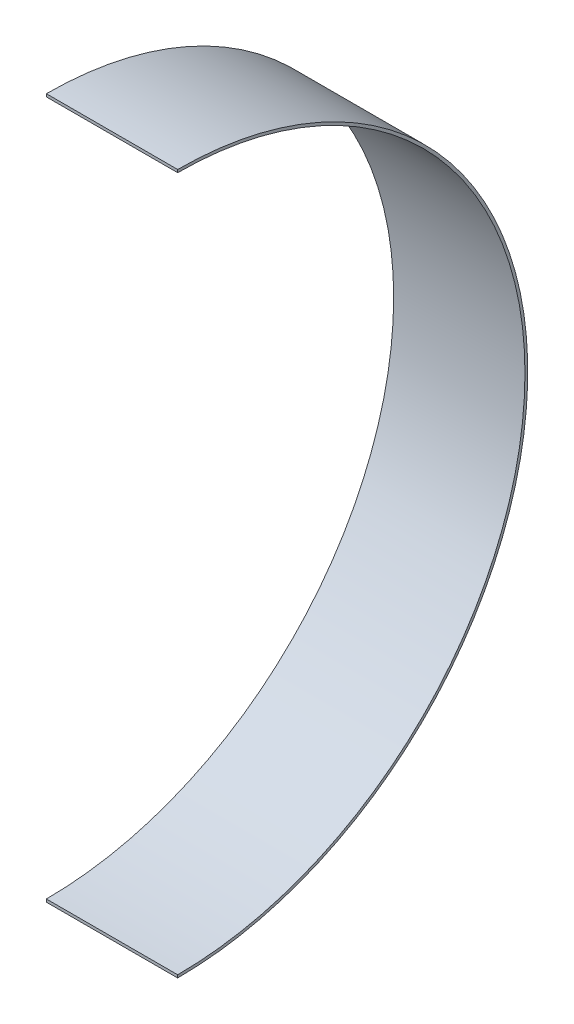
ISO-10303-21;
HEADER;
FILE_DESCRIPTION(('STEP AP214'),'2;1');
FILE_NAME('part.step','',(''),(''),'','','');
FILE_SCHEMA(('AUTOMOTIVE_DESIGN { 1 0 10303 214 1 1 1 1 }'));
ENDSEC;
DATA;
#1=APPLICATION_CONTEXT('core data for automotive mechanical design processes');
#2=APPLICATION_PROTOCOL_DEFINITION('international standard','automotive_design',2000,#1);
#3=PRODUCT_CONTEXT('',#1,'mechanical');
#4=PRODUCT('Part','Part','',(#3));
#5=PRODUCT_RELATED_PRODUCT_CATEGORY('part','',(#4));
#6=PRODUCT_DEFINITION_FORMATION('','',#4);
#7=PRODUCT_DEFINITION_CONTEXT('part definition',#1,'design');
#8=PRODUCT_DEFINITION('design','',#6,#7);
#9=PRODUCT_DEFINITION_SHAPE('','',#8);
#10=(LENGTH_UNIT() NAMED_UNIT(*) SI_UNIT(.MILLI.,.METRE.));
#11=(NAMED_UNIT(*) PLANE_ANGLE_UNIT() SI_UNIT($,.RADIAN.));
#12=(NAMED_UNIT(*) SI_UNIT($,.STERADIAN.) SOLID_ANGLE_UNIT());
#13=UNCERTAINTY_MEASURE_WITH_UNIT(LENGTH_MEASURE(1.E-05),#10,'distance_accuracy_value','');
#14=(GEOMETRIC_REPRESENTATION_CONTEXT(3) GLOBAL_UNCERTAINTY_ASSIGNED_CONTEXT((#13)) GLOBAL_UNIT_ASSIGNED_CONTEXT((#10,
#11,#12)) REPRESENTATION_CONTEXT('',''));
#15=CARTESIAN_POINT('',(0.,0.,0.));
#16=DIRECTION('',(0.,0.,1.));
#17=DIRECTION('',(1.,0.,0.));
#18=AXIS2_PLACEMENT_3D('',#15,#16,#17);
#19=CARTESIAN_POINT('',(75.,0.,0.));
#20=DIRECTION('',(-1.,0.,0.));
#21=DIRECTION('',(0.,0.,1.));
#22=AXIS2_PLACEMENT_3D('',#19,#20,#21);
#23=CYLINDRICAL_SURFACE('',#22,198.4);
#24=CARTESIAN_POINT('',(0.,0.,0.));
#25=DIRECTION('',(1.,0.,0.));
#26=DIRECTION('',(0.,0.,-1.));
#27=AXIS2_PLACEMENT_3D('',#24,#25,#26);
#28=CIRCLE('',#27,198.4);
#29=CARTESIAN_POINT('',(0.,-198.4,0.));
#30=VERTEX_POINT('',#29);
#31=CARTESIAN_POINT('',(0.,198.4,0.));
#32=VERTEX_POINT('',#31);
#33=EDGE_CURVE('E92',#30,#32,#28,.T.);
#34=ORIENTED_EDGE('',*,*,#33,.F.);
#35=DIRECTION('',(-1.,0.,0.));
#36=VECTOR('',#35,1.);
#37=CARTESIAN_POINT('',(75.,-198.4,0.));
#38=LINE('',#37,#36);
#39=CARTESIAN_POINT('',(75.,-198.4,0.));
#40=VERTEX_POINT('',#39);
#41=EDGE_CURVE('E11',#40,#30,#38,.T.);
#42=ORIENTED_EDGE('',*,*,#41,.F.);
#43=CARTESIAN_POINT('',(75.,0.,0.));
#44=DIRECTION('',(1.,0.,0.));
#45=DIRECTION('',(0.,0.,-1.));
#46=AXIS2_PLACEMENT_3D('',#43,#44,#45);
#47=CIRCLE('',#46,198.4);
#48=CARTESIAN_POINT('',(75.,198.4,0.));
#49=VERTEX_POINT('',#48);
#50=EDGE_CURVE('E81',#40,#49,#47,.T.);
#51=ORIENTED_EDGE('',*,*,#50,.T.);
#52=DIRECTION('',(-1.,0.,0.));
#53=VECTOR('',#52,1.);
#54=CARTESIAN_POINT('',(75.,198.4,0.));
#55=LINE('',#54,#53);
#56=EDGE_CURVE('E70',#49,#32,#55,.T.);
#57=ORIENTED_EDGE('',*,*,#56,.T.);
#58=EDGE_LOOP('',(#34,#42,#51,#57));
#59=FACE_BOUND('',#58,.T.);
#60=ADVANCED_FACE('F31',(#59),#23,.F.);
#61=CARTESIAN_POINT('',(75.,0.,0.));
#62=DIRECTION('',(0.,0.,-1.));
#63=DIRECTION('',(-1.,0.,0.));
#64=AXIS2_PLACEMENT_3D('',#61,#62,#63);
#65=PLANE('',#64);
#66=DIRECTION('',(0.,-1.,0.));
#67=VECTOR('',#66,1.);
#68=CARTESIAN_POINT('',(0.,0.,0.));
#69=LINE('',#68,#67);
#70=CARTESIAN_POINT('',(0.,-200.,0.));
#71=VERTEX_POINT('',#70);
#72=EDGE_CURVE('E86',#30,#71,#69,.T.);
#73=ORIENTED_EDGE('',*,*,#72,.T.);
#74=DIRECTION('',(-1.,0.,0.));
#75=VECTOR('',#74,1.);
#76=CARTESIAN_POINT('',(75.,-200.,0.));
#77=LINE('',#76,#75);
#78=CARTESIAN_POINT('',(75.,-200.,0.));
#79=VERTEX_POINT('',#78);
#80=EDGE_CURVE('E39',#79,#71,#77,.T.);
#81=ORIENTED_EDGE('',*,*,#80,.F.);
#82=DIRECTION('',(0.,-1.,0.));
#83=VECTOR('',#82,1.);
#84=CARTESIAN_POINT('',(75.,0.,0.));
#85=LINE('',#84,#83);
#86=EDGE_CURVE('E76',#40,#79,#85,.T.);
#87=ORIENTED_EDGE('',*,*,#86,.F.);
#88=ORIENTED_EDGE('',*,*,#41,.T.);
#89=EDGE_LOOP('',(#73,#81,#87,#88));
#90=FACE_BOUND('',#89,.T.);
#91=ADVANCED_FACE('F84',(#90),#65,.F.);
#92=CARTESIAN_POINT('',(75.,0.,0.));
#93=DIRECTION('',(-1.,0.,0.));
#94=DIRECTION('',(0.,0.,1.));
#95=AXIS2_PLACEMENT_3D('',#92,#93,#94);
#96=CYLINDRICAL_SURFACE('',#95,200.);
#97=CARTESIAN_POINT('',(0.,0.,0.));
#98=DIRECTION('',(1.,0.,0.));
#99=DIRECTION('',(0.,0.,-1.));
#100=AXIS2_PLACEMENT_3D('',#97,#98,#99);
#101=CIRCLE('',#100,200.);
#102=CARTESIAN_POINT('',(0.,200.,0.));
#103=VERTEX_POINT('',#102);
#104=EDGE_CURVE('E63',#71,#103,#101,.T.);
#105=ORIENTED_EDGE('',*,*,#104,.T.);
#106=DIRECTION('',(-1.,0.,0.));
#107=VECTOR('',#106,1.);
#108=CARTESIAN_POINT('',(75.,200.,0.));
#109=LINE('',#108,#107);
#110=CARTESIAN_POINT('',(75.,200.,0.));
#111=VERTEX_POINT('',#110);
#112=EDGE_CURVE('E87',#111,#103,#109,.T.);
#113=ORIENTED_EDGE('',*,*,#112,.F.);
#114=CARTESIAN_POINT('',(75.,0.,0.));
#115=DIRECTION('',(1.,0.,0.));
#116=DIRECTION('',(0.,0.,-1.));
#117=AXIS2_PLACEMENT_3D('',#114,#115,#116);
#118=CIRCLE('',#117,200.);
#119=EDGE_CURVE('E80',#79,#111,#118,.T.);
#120=ORIENTED_EDGE('',*,*,#119,.F.);
#121=ORIENTED_EDGE('',*,*,#80,.T.);
#122=EDGE_LOOP('',(#105,#113,#120,#121));
#123=FACE_BOUND('',#122,.T.);
#124=ADVANCED_FACE('F88',(#123),#96,.T.);
#125=EDGE_CURVE('E96',#103,#32,#69,.T.);
#126=ORIENTED_EDGE('',*,*,#125,.T.);
#127=ORIENTED_EDGE('',*,*,#56,.F.);
#128=EDGE_CURVE('E47',#111,#49,#85,.T.);
#129=ORIENTED_EDGE('',*,*,#128,.F.);
#130=ORIENTED_EDGE('',*,*,#112,.T.);
#131=EDGE_LOOP('',(#126,#127,#129,#130));
#132=FACE_BOUND('',#131,.T.);
#133=ADVANCED_FACE('F101',(#132),#65,.F.);
#134=CARTESIAN_POINT('',(75.,0.,-440.141421356237));
#135=DIRECTION('',(1.,0.,0.));
#136=DIRECTION('',(0.,0.,-1.));
#137=AXIS2_PLACEMENT_3D('',#134,#135,#136);
#138=PLANE('',#137);
#139=ORIENTED_EDGE('',*,*,#50,.F.);
#140=ORIENTED_EDGE('',*,*,#86,.T.);
#141=ORIENTED_EDGE('',*,*,#119,.T.);
#142=ORIENTED_EDGE('',*,*,#128,.T.);
#143=EDGE_LOOP('',(#139,#140,#141,#142));
#144=FACE_BOUND('',#143,.T.);
#145=ADVANCED_FACE('F78',(#144),#138,.T.);
#146=CARTESIAN_POINT('',(0.,0.,-440.141421356237));
#147=DIRECTION('',(1.,0.,0.));
#148=DIRECTION('',(0.,0.,-1.));
#149=AXIS2_PLACEMENT_3D('',#146,#147,#148);
#150=PLANE('',#149);
#151=ORIENTED_EDGE('',*,*,#33,.T.);
#152=ORIENTED_EDGE('',*,*,#125,.F.);
#153=ORIENTED_EDGE('',*,*,#104,.F.);
#154=ORIENTED_EDGE('',*,*,#72,.F.);
#155=EDGE_LOOP('',(#151,#152,#153,#154));
#156=FACE_BOUND('',#155,.T.);
#157=ADVANCED_FACE('F103',(#156),#150,.F.);
#158=CLOSED_SHELL('',(#60,#91,#124,#133,#145,#157));
#159=MANIFOLD_SOLID_BREP('B2',#158);
#160=ADVANCED_BREP_SHAPE_REPRESENTATION('',(#18,#159),#14);
#161=SHAPE_DEFINITION_REPRESENTATION(#9,#160);
ENDSEC;
END-ISO-10303-21;
